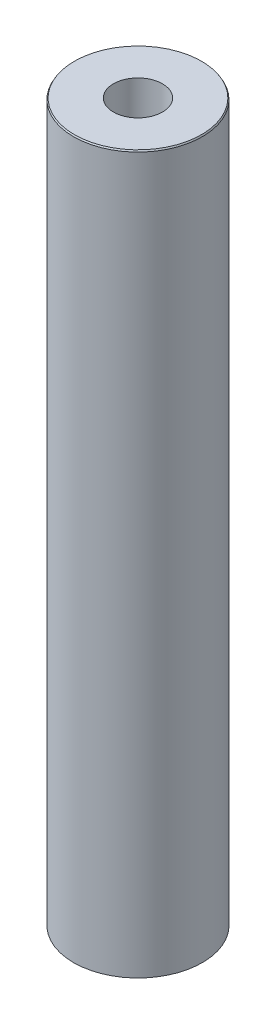
ISO-10303-21;
HEADER;
FILE_DESCRIPTION(('STEP AP214'),'2;1');
FILE_NAME('part.step','',(''),(''),'','','');
FILE_SCHEMA(('AUTOMOTIVE_DESIGN { 1 0 10303 214 1 1 1 1 }'));
ENDSEC;
DATA;
#1=APPLICATION_CONTEXT('core data for automotive mechanical design processes');
#2=APPLICATION_PROTOCOL_DEFINITION('international standard','automotive_design',2000,#1);
#3=PRODUCT_CONTEXT('',#1,'mechanical');
#4=PRODUCT('Part','Part','',(#3));
#5=PRODUCT_RELATED_PRODUCT_CATEGORY('part','',(#4));
#6=PRODUCT_DEFINITION_FORMATION('','',#4);
#7=PRODUCT_DEFINITION_CONTEXT('part definition',#1,'design');
#8=PRODUCT_DEFINITION('design','',#6,#7);
#9=PRODUCT_DEFINITION_SHAPE('','',#8);
#10=(LENGTH_UNIT() NAMED_UNIT(*) SI_UNIT(.MILLI.,.METRE.));
#11=(NAMED_UNIT(*) PLANE_ANGLE_UNIT() SI_UNIT($,.RADIAN.));
#12=(NAMED_UNIT(*) SI_UNIT($,.STERADIAN.) SOLID_ANGLE_UNIT());
#13=UNCERTAINTY_MEASURE_WITH_UNIT(LENGTH_MEASURE(1.E-05),#10,'distance_accuracy_value','');
#14=(GEOMETRIC_REPRESENTATION_CONTEXT(3) GLOBAL_UNCERTAINTY_ASSIGNED_CONTEXT((#13)) GLOBAL_UNIT_ASSIGNED_CONTEXT((#10,
#11,#12)) REPRESENTATION_CONTEXT('',''));
#15=CARTESIAN_POINT('',(0.,0.,0.));
#16=DIRECTION('',(0.,0.,1.));
#17=DIRECTION('',(1.,0.,0.));
#18=AXIS2_PLACEMENT_3D('',#15,#16,#17);
#19=CARTESIAN_POINT('',(0.,445.623488211876,0.));
#20=DIRECTION('',(0.,-1.,0.));
#21=DIRECTION('',(0.,0.,-1.));
#22=AXIS2_PLACEMENT_3D('',#19,#20,#21);
#23=CYLINDRICAL_SURFACE('',#22,40.);
#24=CARTESIAN_POINT('',(0.,444.752552089365,0.));
#25=DIRECTION('',(0.,1.,0.));
#26=DIRECTION('',(0.,0.,1.));
#27=AXIS2_PLACEMENT_3D('',#24,#25,#26);
#28=CIRCLE('',#27,40.);
#29=CARTESIAN_POINT('',(0.,444.752552089365,40.));
#30=VERTEX_POINT('',#29);
#31=EDGE_CURVE('E50',#30,#30,#28,.F.);
#32=ORIENTED_EDGE('',*,*,#31,.T.);
#33=EDGE_LOOP('',(#32));
#34=FACE_BOUND('',#33,.T.);
#35=CARTESIAN_POINT('',(0.,0.502835204778784,0.));
#36=DIRECTION('',(0.,1.,0.));
#37=DIRECTION('',(0.,0.,1.));
#38=AXIS2_PLACEMENT_3D('',#35,#36,#37);
#39=CIRCLE('',#38,40.);
#40=CARTESIAN_POINT('',(0.,0.502835204778784,40.));
#41=VERTEX_POINT('',#40);
#42=EDGE_CURVE('E51',#41,#41,#39,.T.);
#43=ORIENTED_EDGE('',*,*,#42,.T.);
#44=EDGE_LOOP('',(#43));
#45=FACE_BOUND('',#44,.T.);
#46=ADVANCED_FACE('F39',(#34,#45),#23,.T.);
#47=CARTESIAN_POINT('',(0.,445.623488211876,0.));
#48=DIRECTION('',(0.,1.,0.));
#49=DIRECTION('',(0.,0.,1.));
#50=AXIS2_PLACEMENT_3D('',#47,#48,#49);
#51=PLANE('',#50);
#52=CARTESIAN_POINT('',(0.,445.623488211876,0.));
#53=DIRECTION('',(0.,1.,0.));
#54=DIRECTION('',(0.,0.,1.));
#55=AXIS2_PLACEMENT_3D('',#52,#53,#54);
#56=CIRCLE('',#55,39.4971647952212);
#57=CARTESIAN_POINT('',(0.,445.623488211876,39.4971647952212));
#58=VERTEX_POINT('',#57);
#59=EDGE_CURVE('E54',#58,#58,#56,.T.);
#60=ORIENTED_EDGE('',*,*,#59,.T.);
#61=EDGE_LOOP('',(#60));
#62=FACE_BOUND('',#61,.T.);
#63=CARTESIAN_POINT('',(0.,445.623488211876,0.));
#64=DIRECTION('',(0.,1.,0.));
#65=DIRECTION('',(0.,0.,1.));
#66=AXIS2_PLACEMENT_3D('',#63,#64,#65);
#67=CIRCLE('',#66,15.2316050115087);
#68=CARTESIAN_POINT('',(0.,445.623488211876,15.2316050115087));
#69=VERTEX_POINT('',#68);
#70=EDGE_CURVE('E58',#69,#69,#67,.T.);
#71=ORIENTED_EDGE('',*,*,#70,.F.);
#72=EDGE_LOOP('',(#71));
#73=FACE_BOUND('',#72,.T.);
#74=ADVANCED_FACE('F69',(#62,#73),#51,.T.);
#75=CARTESIAN_POINT('',(0.,0.,0.));
#76=DIRECTION('',(0.,1.,0.));
#77=DIRECTION('',(0.,0.,1.));
#78=AXIS2_PLACEMENT_3D('',#75,#76,#77);
#79=PLANE('',#78);
#80=CARTESIAN_POINT('',(0.,0.,0.));
#81=DIRECTION('',(0.,1.,0.));
#82=DIRECTION('',(0.,0.,1.));
#83=AXIS2_PLACEMENT_3D('',#80,#81,#82);
#84=CIRCLE('',#83,39.1290638774888);
#85=CARTESIAN_POINT('',(0.,0.,39.1290638774888));
#86=VERTEX_POINT('',#85);
#87=EDGE_CURVE('E10',#86,#86,#84,.F.);
#88=ORIENTED_EDGE('',*,*,#87,.T.);
#89=EDGE_LOOP('',(#88));
#90=FACE_BOUND('',#89,.T.);
#91=CARTESIAN_POINT('',(0.,0.,0.));
#92=DIRECTION('',(0.,1.,0.));
#93=DIRECTION('',(0.,0.,1.));
#94=AXIS2_PLACEMENT_3D('',#91,#92,#93);
#95=CIRCLE('',#94,15.2316050115087);
#96=CARTESIAN_POINT('',(0.,0.,15.2316050115087));
#97=VERTEX_POINT('',#96);
#98=EDGE_CURVE('E63',#97,#97,#95,.T.);
#99=ORIENTED_EDGE('',*,*,#98,.T.);
#100=EDGE_LOOP('',(#99));
#101=FACE_BOUND('',#100,.T.);
#102=ADVANCED_FACE('F75',(#90,#101),#79,.F.);
#103=CARTESIAN_POINT('',(0.,445.623488211876,0.));
#104=DIRECTION('',(0.,-1.,0.));
#105=DIRECTION('',(0.,0.,-1.));
#106=AXIS2_PLACEMENT_3D('',#103,#104,#105);
#107=CYLINDRICAL_SURFACE('',#106,15.2316050115087);
#108=ORIENTED_EDGE('',*,*,#70,.T.);
#109=EDGE_LOOP('',(#108));
#110=FACE_BOUND('',#109,.T.);
#111=ORIENTED_EDGE('',*,*,#98,.F.);
#112=EDGE_LOOP('',(#111));
#113=FACE_BOUND('',#112,.T.);
#114=ADVANCED_FACE('F70',(#110,#113),#107,.F.);
#115=CARTESIAN_POINT('',(0.,445.623488211876,0.));
#116=DIRECTION('',(0.,-1.,0.));
#117=DIRECTION('',(0.,0.,-1.));
#118=AXIS2_PLACEMENT_3D('',#115,#116,#117);
#119=CONICAL_SURFACE('',#118,39.4971647952212,0.523598775598292);
#120=ORIENTED_EDGE('',*,*,#31,.F.);
#121=EDGE_LOOP('',(#120));
#122=FACE_BOUND('',#121,.T.);
#123=ORIENTED_EDGE('',*,*,#59,.F.);
#124=EDGE_LOOP('',(#123));
#125=FACE_BOUND('',#124,.T.);
#126=ADVANCED_FACE('F81',(#122,#125),#119,.T.);
#127=CARTESIAN_POINT('',(0.,0.502835204778784,0.));
#128=DIRECTION('',(0.,1.,0.));
#129=DIRECTION('',(0.,0.,1.));
#130=AXIS2_PLACEMENT_3D('',#127,#128,#129);
#131=CONICAL_SURFACE('',#130,40.,1.04719755119661);
#132=ORIENTED_EDGE('',*,*,#87,.F.);
#133=EDGE_LOOP('',(#132));
#134=FACE_BOUND('',#133,.T.);
#135=ORIENTED_EDGE('',*,*,#42,.F.);
#136=EDGE_LOOP('',(#135));
#137=FACE_BOUND('',#136,.T.);
#138=ADVANCED_FACE('F45',(#134,#137),#131,.T.);
#139=CLOSED_SHELL('',(#46,#74,#102,#114,#126,#138));
#140=MANIFOLD_SOLID_BREP('B2',#139);
#141=ADVANCED_BREP_SHAPE_REPRESENTATION('',(#18,#140),#14);
#142=SHAPE_DEFINITION_REPRESENTATION(#9,#141);
ENDSEC;
END-ISO-10303-21;
